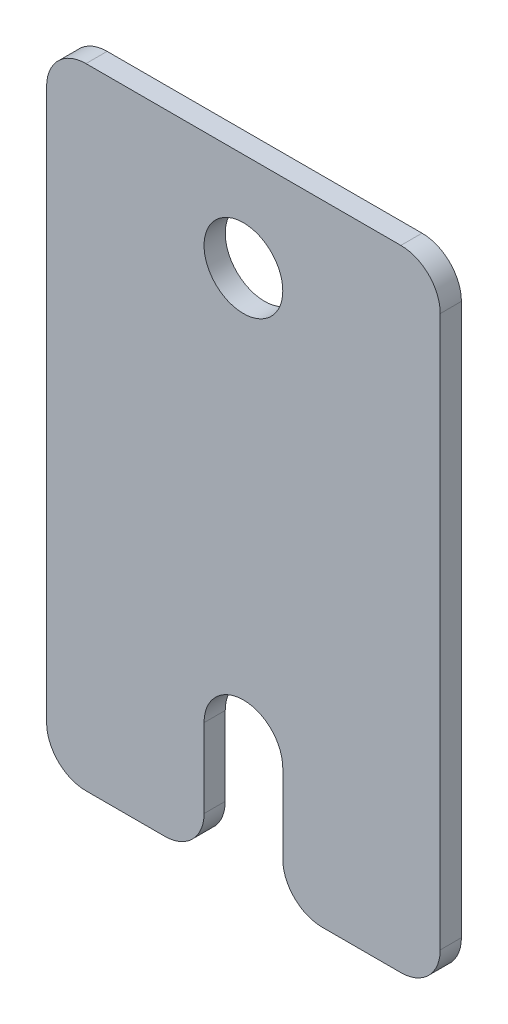
ISO-10303-21;
HEADER;
FILE_DESCRIPTION(('STEP AP214'),'2;1');
FILE_NAME('part.step','',(''),(''),'','','');
FILE_SCHEMA(('AUTOMOTIVE_DESIGN { 1 0 10303 214 1 1 1 1 }'));
ENDSEC;
DATA;
#1=APPLICATION_CONTEXT('core data for automotive mechanical design processes');
#2=APPLICATION_PROTOCOL_DEFINITION('international standard','automotive_design',2000,#1);
#3=PRODUCT_CONTEXT('',#1,'mechanical');
#4=PRODUCT('Part','Part','',(#3));
#5=PRODUCT_RELATED_PRODUCT_CATEGORY('part','',(#4));
#6=PRODUCT_DEFINITION_FORMATION('','',#4);
#7=PRODUCT_DEFINITION_CONTEXT('part definition',#1,'design');
#8=PRODUCT_DEFINITION('design','',#6,#7);
#9=PRODUCT_DEFINITION_SHAPE('','',#8);
#10=(LENGTH_UNIT() NAMED_UNIT(*) SI_UNIT(.MILLI.,.METRE.));
#11=(NAMED_UNIT(*) PLANE_ANGLE_UNIT() SI_UNIT($,.RADIAN.));
#12=(NAMED_UNIT(*) SI_UNIT($,.STERADIAN.) SOLID_ANGLE_UNIT());
#13=UNCERTAINTY_MEASURE_WITH_UNIT(LENGTH_MEASURE(1.E-05),#10,'distance_accuracy_value','');
#14=(GEOMETRIC_REPRESENTATION_CONTEXT(3) GLOBAL_UNCERTAINTY_ASSIGNED_CONTEXT((#13)) GLOBAL_UNIT_ASSIGNED_CONTEXT((#10,
#11,#12)) REPRESENTATION_CONTEXT('',''));
#15=CARTESIAN_POINT('',(0.,0.,0.));
#16=DIRECTION('',(0.,0.,1.));
#17=DIRECTION('',(1.,0.,0.));
#18=AXIS2_PLACEMENT_3D('',#15,#16,#17);
#19=CARTESIAN_POINT('',(31.75,-50.8,-3.4163));
#20=DIRECTION('',(0.,-1.,0.));
#21=DIRECTION('',(0.,0.,-1.));
#22=AXIS2_PLACEMENT_3D('',#19,#20,#21);
#23=PLANE('',#22);
#24=DIRECTION('',(1.,0.,0.));
#25=VECTOR('',#24,1.);
#26=CARTESIAN_POINT('',(31.75,-50.8,0.));
#27=LINE('',#26,#25);
#28=CARTESIAN_POINT('',(12.7,-50.8,0.));
#29=VERTEX_POINT('',#28);
#30=CARTESIAN_POINT('',(25.4,-50.8,0.));
#31=VERTEX_POINT('',#30);
#32=EDGE_CURVE('E195',#29,#31,#27,.T.);
#33=ORIENTED_EDGE('',*,*,#32,.F.);
#34=DIRECTION('',(0.,0.,1.));
#35=VECTOR('',#34,1.);
#36=CARTESIAN_POINT('',(12.7,-50.8,-3.4163));
#37=LINE('',#36,#35);
#38=CARTESIAN_POINT('',(12.7,-50.8,-3.4163));
#39=VERTEX_POINT('',#38);
#40=EDGE_CURVE('E222',#29,#39,#37,.F.);
#41=ORIENTED_EDGE('',*,*,#40,.T.);
#42=DIRECTION('',(1.,0.,0.));
#43=VECTOR('',#42,1.);
#44=CARTESIAN_POINT('',(31.75,-50.8,-3.4163));
#45=LINE('',#44,#43);
#46=CARTESIAN_POINT('',(25.4,-50.8,-3.4163));
#47=VERTEX_POINT('',#46);
#48=EDGE_CURVE('E181',#39,#47,#45,.T.);
#49=ORIENTED_EDGE('',*,*,#48,.T.);
#50=DIRECTION('',(0.,0.,1.));
#51=VECTOR('',#50,1.);
#52=CARTESIAN_POINT('',(25.4,-50.8,-3.4163));
#53=LINE('',#52,#51);
#54=EDGE_CURVE('E219',#47,#31,#53,.T.);
#55=ORIENTED_EDGE('',*,*,#54,.T.);
#56=EDGE_LOOP('',(#33,#41,#49,#55));
#57=FACE_BOUND('',#56,.T.);
#58=ADVANCED_FACE('F38',(#57),#23,.T.);
#59=CARTESIAN_POINT('',(-31.75,50.8,-3.4163));
#60=DIRECTION('',(-1.,0.,0.));
#61=DIRECTION('',(0.,-1.,0.));
#62=AXIS2_PLACEMENT_3D('',#59,#60,#61);
#63=PLANE('',#62);
#64=DIRECTION('',(0.,-1.,0.));
#65=VECTOR('',#64,1.);
#66=CARTESIAN_POINT('',(-31.75,50.8,-3.4163));
#67=LINE('',#66,#65);
#68=CARTESIAN_POINT('',(-31.75,44.45,-3.4163));
#69=VERTEX_POINT('',#68);
#70=CARTESIAN_POINT('',(-31.75,-44.45,-3.4163));
#71=VERTEX_POINT('',#70);
#72=EDGE_CURVE('E178',#69,#71,#67,.T.);
#73=ORIENTED_EDGE('',*,*,#72,.T.);
#74=DIRECTION('',(0.,0.,1.));
#75=VECTOR('',#74,1.);
#76=CARTESIAN_POINT('',(-31.75,-44.45,-3.4163));
#77=LINE('',#76,#75);
#78=CARTESIAN_POINT('',(-31.75,-44.45,0.));
#79=VERTEX_POINT('',#78);
#80=EDGE_CURVE('E247',#71,#79,#77,.T.);
#81=ORIENTED_EDGE('',*,*,#80,.T.);
#82=DIRECTION('',(0.,-1.,0.));
#83=VECTOR('',#82,1.);
#84=CARTESIAN_POINT('',(-31.75,50.8,0.));
#85=LINE('',#84,#83);
#86=CARTESIAN_POINT('',(-31.75,44.45,0.));
#87=VERTEX_POINT('',#86);
#88=EDGE_CURVE('E192',#87,#79,#85,.T.);
#89=ORIENTED_EDGE('',*,*,#88,.F.);
#90=DIRECTION('',(0.,0.,1.));
#91=VECTOR('',#90,1.);
#92=CARTESIAN_POINT('',(-31.75,44.45,-3.4163));
#93=LINE('',#92,#91);
#94=EDGE_CURVE('E245',#87,#69,#93,.F.);
#95=ORIENTED_EDGE('',*,*,#94,.T.);
#96=EDGE_LOOP('',(#73,#81,#89,#95));
#97=FACE_BOUND('',#96,.T.);
#98=ADVANCED_FACE('F290',(#97),#63,.T.);
#99=CARTESIAN_POINT('',(31.75,50.8,-3.4163));
#100=DIRECTION('',(0.,1.,0.));
#101=DIRECTION('',(0.,0.,1.));
#102=AXIS2_PLACEMENT_3D('',#99,#100,#101);
#103=PLANE('',#102);
#104=DIRECTION('',(-1.,0.,0.));
#105=VECTOR('',#104,1.);
#106=CARTESIAN_POINT('',(31.75,50.8,-3.4163));
#107=LINE('',#106,#105);
#108=CARTESIAN_POINT('',(25.4,50.8,-3.4163));
#109=VERTEX_POINT('',#108);
#110=CARTESIAN_POINT('',(-25.4,50.8,-3.4163));
#111=VERTEX_POINT('',#110);
#112=EDGE_CURVE('E188',#109,#111,#107,.T.);
#113=ORIENTED_EDGE('',*,*,#112,.T.);
#114=DIRECTION('',(0.,0.,1.));
#115=VECTOR('',#114,1.);
#116=CARTESIAN_POINT('',(-25.4,50.8,-3.4163));
#117=LINE('',#116,#115);
#118=CARTESIAN_POINT('',(-25.4,50.8,0.));
#119=VERTEX_POINT('',#118);
#120=EDGE_CURVE('E11',#111,#119,#117,.T.);
#121=ORIENTED_EDGE('',*,*,#120,.T.);
#122=DIRECTION('',(-1.,0.,0.));
#123=VECTOR('',#122,1.);
#124=CARTESIAN_POINT('',(31.75,50.8,0.));
#125=LINE('',#124,#123);
#126=CARTESIAN_POINT('',(25.4,50.8,0.));
#127=VERTEX_POINT('',#126);
#128=EDGE_CURVE('E182',#127,#119,#125,.T.);
#129=ORIENTED_EDGE('',*,*,#128,.F.);
#130=DIRECTION('',(0.,0.,1.));
#131=VECTOR('',#130,1.);
#132=CARTESIAN_POINT('',(25.4,50.8,-3.4163));
#133=LINE('',#132,#131);
#134=EDGE_CURVE('E46',#127,#109,#133,.F.);
#135=ORIENTED_EDGE('',*,*,#134,.T.);
#136=EDGE_LOOP('',(#113,#121,#129,#135));
#137=FACE_BOUND('',#136,.T.);
#138=ADVANCED_FACE('F252',(#137),#103,.T.);
#139=CARTESIAN_POINT('',(31.75,50.8,-3.4163));
#140=DIRECTION('',(1.,0.,0.));
#141=DIRECTION('',(0.,1.,0.));
#142=AXIS2_PLACEMENT_3D('',#139,#140,#141);
#143=PLANE('',#142);
#144=DIRECTION('',(0.,1.,0.));
#145=VECTOR('',#144,1.);
#146=CARTESIAN_POINT('',(31.75,50.8,0.));
#147=LINE('',#146,#145);
#148=CARTESIAN_POINT('',(31.75,-44.45,0.));
#149=VERTEX_POINT('',#148);
#150=CARTESIAN_POINT('',(31.75,44.45,0.));
#151=VERTEX_POINT('',#150);
#152=EDGE_CURVE('E200',#149,#151,#147,.T.);
#153=ORIENTED_EDGE('',*,*,#152,.F.);
#154=DIRECTION('',(0.,0.,1.));
#155=VECTOR('',#154,1.);
#156=CARTESIAN_POINT('',(31.75,-44.45,-3.4163));
#157=LINE('',#156,#155);
#158=CARTESIAN_POINT('',(31.75,-44.45,-3.4163));
#159=VERTEX_POINT('',#158);
#160=EDGE_CURVE('E60',#149,#159,#157,.F.);
#161=ORIENTED_EDGE('',*,*,#160,.T.);
#162=DIRECTION('',(0.,1.,0.));
#163=VECTOR('',#162,1.);
#164=CARTESIAN_POINT('',(31.75,50.8,-3.4163));
#165=LINE('',#164,#163);
#166=CARTESIAN_POINT('',(31.75,44.45,-3.4163));
#167=VERTEX_POINT('',#166);
#168=EDGE_CURVE('E186',#159,#167,#165,.T.);
#169=ORIENTED_EDGE('',*,*,#168,.T.);
#170=DIRECTION('',(0.,0.,1.));
#171=VECTOR('',#170,1.);
#172=CARTESIAN_POINT('',(31.75,44.45,-3.4163));
#173=LINE('',#172,#171);
#174=EDGE_CURVE('E241',#167,#151,#173,.T.);
#175=ORIENTED_EDGE('',*,*,#174,.T.);
#176=EDGE_LOOP('',(#153,#161,#169,#175));
#177=FACE_BOUND('',#176,.T.);
#178=ADVANCED_FACE('F258',(#177),#143,.T.);
#179=CARTESIAN_POINT('',(-25.4,-50.8,-3.4163));
#180=VERTEX_POINT('',#179);
#181=CARTESIAN_POINT('',(-12.7,-50.8,-3.4163));
#182=VERTEX_POINT('',#181);
#183=EDGE_CURVE('E183',#180,#182,#45,.T.);
#184=ORIENTED_EDGE('',*,*,#183,.T.);
#185=DIRECTION('',(0.,0.,1.));
#186=VECTOR('',#185,1.);
#187=CARTESIAN_POINT('',(-12.7,-50.8,0.));
#188=LINE('',#187,#186);
#189=CARTESIAN_POINT('',(-12.7,-50.8,0.));
#190=VERTEX_POINT('',#189);
#191=EDGE_CURVE('E237',#182,#190,#188,.T.);
#192=ORIENTED_EDGE('',*,*,#191,.T.);
#193=CARTESIAN_POINT('',(-25.4,-50.8,0.));
#194=VERTEX_POINT('',#193);
#195=EDGE_CURVE('E197',#194,#190,#27,.T.);
#196=ORIENTED_EDGE('',*,*,#195,.F.);
#197=DIRECTION('',(0.,0.,1.));
#198=VECTOR('',#197,1.);
#199=CARTESIAN_POINT('',(-25.4,-50.8,-3.4163));
#200=LINE('',#199,#198);
#201=EDGE_CURVE('E235',#194,#180,#200,.F.);
#202=ORIENTED_EDGE('',*,*,#201,.T.);
#203=EDGE_LOOP('',(#184,#192,#196,#202));
#204=FACE_BOUND('',#203,.T.);
#205=ADVANCED_FACE('F283',(#204),#23,.T.);
#206=CARTESIAN_POINT('',(0.,0.,-3.4163));
#207=DIRECTION('',(0.,0.,-1.));
#208=DIRECTION('',(-1.,0.,0.));
#209=AXIS2_PLACEMENT_3D('',#206,#207,#208);
#210=PLANE('',#209);
#211=CARTESIAN_POINT('',(0.,34.925,-3.4163));
#212=DIRECTION('',(0.,0.,1.));
#213=DIRECTION('',(1.,0.,0.));
#214=AXIS2_PLACEMENT_3D('',#211,#212,#213);
#215=CIRCLE('',#214,6.35);
#216=CARTESIAN_POINT('',(6.35,34.925,-3.4163));
#217=VERTEX_POINT('',#216);
#218=EDGE_CURVE('E196',#217,#217,#215,.T.);
#219=ORIENTED_EDGE('',*,*,#218,.T.);
#220=EDGE_LOOP('',(#219));
#221=FACE_BOUND('',#220,.T.);
#222=ORIENTED_EDGE('',*,*,#48,.F.);
#223=CARTESIAN_POINT('',(12.7,-44.45,-3.4163));
#224=DIRECTION('',(0.,0.,-1.));
#225=DIRECTION('',(-1.,0.,0.));
#226=AXIS2_PLACEMENT_3D('',#223,#224,#225);
#227=CIRCLE('',#226,6.35);
#228=CARTESIAN_POINT('',(6.35,-44.45,-3.4163));
#229=VERTEX_POINT('',#228);
#230=EDGE_CURVE('E233',#39,#229,#227,.T.);
#231=ORIENTED_EDGE('',*,*,#230,.T.);
#232=DIRECTION('',(0.,1.,0.));
#233=VECTOR('',#232,1.);
#234=CARTESIAN_POINT('',(6.35,-31.75,-3.4163));
#235=LINE('',#234,#233);
#236=CARTESIAN_POINT('',(6.35,-31.75,-3.4163));
#237=VERTEX_POINT('',#236);
#238=EDGE_CURVE('E153',#229,#237,#235,.T.);
#239=ORIENTED_EDGE('',*,*,#238,.T.);
#240=CARTESIAN_POINT('',(0.,-31.75,-3.4163));
#241=DIRECTION('',(0.,0.,1.));
#242=DIRECTION('',(1.,0.,0.));
#243=AXIS2_PLACEMENT_3D('',#240,#241,#242);
#244=CIRCLE('',#243,6.35);
#245=CARTESIAN_POINT('',(-6.35,-31.75,-3.4163));
#246=VERTEX_POINT('',#245);
#247=EDGE_CURVE('E146',#237,#246,#244,.T.);
#248=ORIENTED_EDGE('',*,*,#247,.T.);
#249=DIRECTION('',(0.,-1.,0.));
#250=VECTOR('',#249,1.);
#251=CARTESIAN_POINT('',(-6.35,-31.75,-3.4163));
#252=LINE('',#251,#250);
#253=CARTESIAN_POINT('',(-6.35,-44.45,-3.4163));
#254=VERTEX_POINT('',#253);
#255=EDGE_CURVE('E156',#246,#254,#252,.T.);
#256=ORIENTED_EDGE('',*,*,#255,.T.);
#257=CARTESIAN_POINT('',(-12.7,-44.45,-3.4163));
#258=DIRECTION('',(0.,0.,-1.));
#259=DIRECTION('',(-1.,0.,0.));
#260=AXIS2_PLACEMENT_3D('',#257,#258,#259);
#261=CIRCLE('',#260,6.35);
#262=EDGE_CURVE('E231',#254,#182,#261,.T.);
#263=ORIENTED_EDGE('',*,*,#262,.T.);
#264=ORIENTED_EDGE('',*,*,#183,.F.);
#265=CARTESIAN_POINT('',(-25.4,-44.45,-3.4163));
#266=DIRECTION('',(0.,0.,-1.));
#267=DIRECTION('',(-1.,0.,0.));
#268=AXIS2_PLACEMENT_3D('',#265,#266,#267);
#269=CIRCLE('',#268,6.35);
#270=EDGE_CURVE('E227',#180,#71,#269,.T.);
#271=ORIENTED_EDGE('',*,*,#270,.T.);
#272=ORIENTED_EDGE('',*,*,#72,.F.);
#273=CARTESIAN_POINT('',(-25.4,44.45,-3.4163));
#274=DIRECTION('',(0.,0.,-1.));
#275=DIRECTION('',(-1.,0.,0.));
#276=AXIS2_PLACEMENT_3D('',#273,#274,#275);
#277=CIRCLE('',#276,6.35);
#278=EDGE_CURVE('E225',#69,#111,#277,.T.);
#279=ORIENTED_EDGE('',*,*,#278,.T.);
#280=ORIENTED_EDGE('',*,*,#112,.F.);
#281=CARTESIAN_POINT('',(25.4,44.45,-3.4163));
#282=DIRECTION('',(0.,0.,-1.));
#283=DIRECTION('',(-1.,0.,0.));
#284=AXIS2_PLACEMENT_3D('',#281,#282,#283);
#285=CIRCLE('',#284,6.35);
#286=EDGE_CURVE('E53',#109,#167,#285,.T.);
#287=ORIENTED_EDGE('',*,*,#286,.T.);
#288=ORIENTED_EDGE('',*,*,#168,.F.);
#289=CARTESIAN_POINT('',(25.4,-44.45,-3.4163));
#290=DIRECTION('',(0.,0.,-1.));
#291=DIRECTION('',(-1.,0.,0.));
#292=AXIS2_PLACEMENT_3D('',#289,#290,#291);
#293=CIRCLE('',#292,6.35);
#294=EDGE_CURVE('E229',#159,#47,#293,.T.);
#295=ORIENTED_EDGE('',*,*,#294,.T.);
#296=EDGE_LOOP('',(#222,#231,#239,#248,#256,#263,#264,#271,#272,#279,#280,#287,#288,#295));
#297=FACE_BOUND('',#296,.T.);
#298=ADVANCED_FACE('F163',(#221,#297),#210,.T.);
#299=CARTESIAN_POINT('',(0.,0.,0.));
#300=DIRECTION('',(0.,0.,-1.));
#301=DIRECTION('',(-1.,0.,0.));
#302=AXIS2_PLACEMENT_3D('',#299,#300,#301);
#303=PLANE('',#302);
#304=CARTESIAN_POINT('',(0.,34.925,0.));
#305=DIRECTION('',(0.,0.,1.));
#306=DIRECTION('',(1.,0.,0.));
#307=AXIS2_PLACEMENT_3D('',#304,#305,#306);
#308=CIRCLE('',#307,6.35);
#309=CARTESIAN_POINT('',(6.35,34.925,0.));
#310=VERTEX_POINT('',#309);
#311=EDGE_CURVE('E171',#310,#310,#308,.T.);
#312=ORIENTED_EDGE('',*,*,#311,.F.);
#313=EDGE_LOOP('',(#312));
#314=FACE_BOUND('',#313,.T.);
#315=DIRECTION('',(0.,1.,0.));
#316=VECTOR('',#315,1.);
#317=CARTESIAN_POINT('',(6.35,-31.75,0.));
#318=LINE('',#317,#316);
#319=CARTESIAN_POINT('',(6.35,-44.45,0.));
#320=VERTEX_POINT('',#319);
#321=CARTESIAN_POINT('',(6.35,-31.75,0.));
#322=VERTEX_POINT('',#321);
#323=EDGE_CURVE('E166',#320,#322,#318,.T.);
#324=ORIENTED_EDGE('',*,*,#323,.F.);
#325=CARTESIAN_POINT('',(12.7,-44.45,0.));
#326=DIRECTION('',(0.,0.,-1.));
#327=DIRECTION('',(-1.,0.,0.));
#328=AXIS2_PLACEMENT_3D('',#325,#326,#327);
#329=CIRCLE('',#328,6.35);
#330=EDGE_CURVE('E217',#320,#29,#329,.F.);
#331=ORIENTED_EDGE('',*,*,#330,.T.);
#332=ORIENTED_EDGE('',*,*,#32,.T.);
#333=CARTESIAN_POINT('',(25.4,-44.45,0.));
#334=DIRECTION('',(0.,0.,-1.));
#335=DIRECTION('',(-1.,0.,0.));
#336=AXIS2_PLACEMENT_3D('',#333,#334,#335);
#337=CIRCLE('',#336,6.35);
#338=EDGE_CURVE('E213',#31,#149,#337,.F.);
#339=ORIENTED_EDGE('',*,*,#338,.T.);
#340=ORIENTED_EDGE('',*,*,#152,.T.);
#341=CARTESIAN_POINT('',(25.4,44.45,0.));
#342=DIRECTION('',(0.,0.,-1.));
#343=DIRECTION('',(-1.,0.,0.));
#344=AXIS2_PLACEMENT_3D('',#341,#342,#343);
#345=CIRCLE('',#344,6.35);
#346=EDGE_CURVE('E207',#151,#127,#345,.F.);
#347=ORIENTED_EDGE('',*,*,#346,.T.);
#348=ORIENTED_EDGE('',*,*,#128,.T.);
#349=CARTESIAN_POINT('',(-25.4,44.45,0.));
#350=DIRECTION('',(0.,0.,-1.));
#351=DIRECTION('',(-1.,0.,0.));
#352=AXIS2_PLACEMENT_3D('',#349,#350,#351);
#353=CIRCLE('',#352,6.35);
#354=EDGE_CURVE('E209',#119,#87,#353,.F.);
#355=ORIENTED_EDGE('',*,*,#354,.T.);
#356=ORIENTED_EDGE('',*,*,#88,.T.);
#357=CARTESIAN_POINT('',(-25.4,-44.45,0.));
#358=DIRECTION('',(0.,0.,-1.));
#359=DIRECTION('',(-1.,0.,0.));
#360=AXIS2_PLACEMENT_3D('',#357,#358,#359);
#361=CIRCLE('',#360,6.35);
#362=EDGE_CURVE('E211',#79,#194,#361,.F.);
#363=ORIENTED_EDGE('',*,*,#362,.T.);
#364=ORIENTED_EDGE('',*,*,#195,.T.);
#365=CARTESIAN_POINT('',(-12.7,-44.45,0.));
#366=DIRECTION('',(0.,0.,-1.));
#367=DIRECTION('',(-1.,0.,0.));
#368=AXIS2_PLACEMENT_3D('',#365,#366,#367);
#369=CIRCLE('',#368,6.35);
#370=CARTESIAN_POINT('',(-6.35,-44.45,0.));
#371=VERTEX_POINT('',#370);
#372=EDGE_CURVE('E215',#190,#371,#369,.F.);
#373=ORIENTED_EDGE('',*,*,#372,.T.);
#374=DIRECTION('',(0.,-1.,0.));
#375=VECTOR('',#374,1.);
#376=CARTESIAN_POINT('',(-6.35,-31.75,0.));
#377=LINE('',#376,#375);
#378=CARTESIAN_POINT('',(-6.35,-31.75,0.));
#379=VERTEX_POINT('',#378);
#380=EDGE_CURVE('E168',#379,#371,#377,.T.);
#381=ORIENTED_EDGE('',*,*,#380,.F.);
#382=CARTESIAN_POINT('',(0.,-31.75,0.));
#383=DIRECTION('',(0.,0.,1.));
#384=DIRECTION('',(1.,0.,0.));
#385=AXIS2_PLACEMENT_3D('',#382,#383,#384);
#386=CIRCLE('',#385,6.35);
#387=EDGE_CURVE('E148',#322,#379,#386,.T.);
#388=ORIENTED_EDGE('',*,*,#387,.F.);
#389=EDGE_LOOP('',(#324,#331,#332,#339,#340,#347,#348,#355,#356,#363,#364,#373,#381,#388));
#390=FACE_BOUND('',#389,.T.);
#391=ADVANCED_FACE('F261',(#314,#390),#303,.F.);
#392=CARTESIAN_POINT('',(0.,-31.75,-3.4163));
#393=DIRECTION('',(0.,0.,1.));
#394=DIRECTION('',(1.,0.,0.));
#395=AXIS2_PLACEMENT_3D('',#392,#393,#394);
#396=CYLINDRICAL_SURFACE('',#395,6.35);
#397=ORIENTED_EDGE('',*,*,#387,.T.);
#398=DIRECTION('',(0.,0.,1.));
#399=VECTOR('',#398,1.);
#400=CARTESIAN_POINT('',(-6.35,-31.75,-3.4163));
#401=LINE('',#400,#399);
#402=EDGE_CURVE('E141',#246,#379,#401,.T.);
#403=ORIENTED_EDGE('',*,*,#402,.F.);
#404=ORIENTED_EDGE('',*,*,#247,.F.);
#405=DIRECTION('',(0.,0.,1.));
#406=VECTOR('',#405,1.);
#407=CARTESIAN_POINT('',(6.35,-31.75,-3.4163));
#408=LINE('',#407,#406);
#409=EDGE_CURVE('E152',#237,#322,#408,.T.);
#410=ORIENTED_EDGE('',*,*,#409,.T.);
#411=EDGE_LOOP('',(#397,#403,#404,#410));
#412=FACE_BOUND('',#411,.T.);
#413=ADVANCED_FACE('F143',(#412),#396,.F.);
#414=CARTESIAN_POINT('',(6.35,-31.75,-3.4163));
#415=DIRECTION('',(1.,0.,0.));
#416=DIRECTION('',(0.,1.,0.));
#417=AXIS2_PLACEMENT_3D('',#414,#415,#416);
#418=PLANE('',#417);
#419=ORIENTED_EDGE('',*,*,#238,.F.);
#420=DIRECTION('',(0.,0.,1.));
#421=VECTOR('',#420,1.);
#422=CARTESIAN_POINT('',(6.35,-44.45,0.));
#423=LINE('',#422,#421);
#424=EDGE_CURVE('E191',#229,#320,#423,.T.);
#425=ORIENTED_EDGE('',*,*,#424,.T.);
#426=ORIENTED_EDGE('',*,*,#323,.T.);
#427=ORIENTED_EDGE('',*,*,#409,.F.);
#428=EDGE_LOOP('',(#419,#425,#426,#427));
#429=FACE_BOUND('',#428,.T.);
#430=ADVANCED_FACE('F276',(#429),#418,.F.);
#431=CARTESIAN_POINT('',(-6.35,-31.75,-3.4163));
#432=DIRECTION('',(-1.,0.,0.));
#433=DIRECTION('',(0.,-1.,0.));
#434=AXIS2_PLACEMENT_3D('',#431,#432,#433);
#435=PLANE('',#434);
#436=ORIENTED_EDGE('',*,*,#380,.T.);
#437=DIRECTION('',(0.,0.,1.));
#438=VECTOR('',#437,1.);
#439=CARTESIAN_POINT('',(-6.35,-44.45,-3.4163));
#440=LINE('',#439,#438);
#441=EDGE_CURVE('E159',#371,#254,#440,.F.);
#442=ORIENTED_EDGE('',*,*,#441,.T.);
#443=ORIENTED_EDGE('',*,*,#255,.F.);
#444=ORIENTED_EDGE('',*,*,#402,.T.);
#445=EDGE_LOOP('',(#436,#442,#443,#444));
#446=FACE_BOUND('',#445,.T.);
#447=ADVANCED_FACE('F157',(#446),#435,.F.);
#448=CARTESIAN_POINT('',(0.,34.925,-3.4163));
#449=DIRECTION('',(0.,0.,1.));
#450=DIRECTION('',(1.,0.,0.));
#451=AXIS2_PLACEMENT_3D('',#448,#449,#450);
#452=CYLINDRICAL_SURFACE('',#451,6.35);
#453=ORIENTED_EDGE('',*,*,#218,.F.);
#454=EDGE_LOOP('',(#453));
#455=FACE_BOUND('',#454,.T.);
#456=ORIENTED_EDGE('',*,*,#311,.T.);
#457=EDGE_LOOP('',(#456));
#458=FACE_BOUND('',#457,.T.);
#459=ADVANCED_FACE('F328',(#455,#458),#452,.F.);
#460=CARTESIAN_POINT('',(12.7,-44.45,-3.4163));
#461=DIRECTION('',(0.,0.,-1.));
#462=DIRECTION('',(-1.,0.,0.));
#463=AXIS2_PLACEMENT_3D('',#460,#461,#462);
#464=CYLINDRICAL_SURFACE('',#463,6.35);
#465=ORIENTED_EDGE('',*,*,#230,.F.);
#466=ORIENTED_EDGE('',*,*,#40,.F.);
#467=ORIENTED_EDGE('',*,*,#330,.F.);
#468=ORIENTED_EDGE('',*,*,#424,.F.);
#469=EDGE_LOOP('',(#465,#466,#467,#468));
#470=FACE_BOUND('',#469,.T.);
#471=ADVANCED_FACE('F274',(#470),#464,.T.);
#472=CARTESIAN_POINT('',(-12.7,-44.45,-3.4163));
#473=DIRECTION('',(0.,0.,-1.));
#474=DIRECTION('',(-1.,0.,0.));
#475=AXIS2_PLACEMENT_3D('',#472,#473,#474);
#476=CYLINDRICAL_SURFACE('',#475,6.35);
#477=ORIENTED_EDGE('',*,*,#262,.F.);
#478=ORIENTED_EDGE('',*,*,#441,.F.);
#479=ORIENTED_EDGE('',*,*,#372,.F.);
#480=ORIENTED_EDGE('',*,*,#191,.F.);
#481=EDGE_LOOP('',(#477,#478,#479,#480));
#482=FACE_BOUND('',#481,.T.);
#483=ADVANCED_FACE('F278',(#482),#476,.T.);
#484=CARTESIAN_POINT('',(25.4,-44.45,-3.4163));
#485=DIRECTION('',(0.,0.,1.));
#486=DIRECTION('',(1.,0.,0.));
#487=AXIS2_PLACEMENT_3D('',#484,#485,#486);
#488=CYLINDRICAL_SURFACE('',#487,6.35);
#489=ORIENTED_EDGE('',*,*,#294,.F.);
#490=ORIENTED_EDGE('',*,*,#160,.F.);
#491=ORIENTED_EDGE('',*,*,#338,.F.);
#492=ORIENTED_EDGE('',*,*,#54,.F.);
#493=EDGE_LOOP('',(#489,#490,#491,#492));
#494=FACE_BOUND('',#493,.T.);
#495=ADVANCED_FACE('F267',(#494),#488,.T.);
#496=CARTESIAN_POINT('',(-25.4,-44.45,-3.4163));
#497=DIRECTION('',(0.,0.,1.));
#498=DIRECTION('',(1.,0.,0.));
#499=AXIS2_PLACEMENT_3D('',#496,#497,#498);
#500=CYLINDRICAL_SURFACE('',#499,6.35);
#501=ORIENTED_EDGE('',*,*,#270,.F.);
#502=ORIENTED_EDGE('',*,*,#201,.F.);
#503=ORIENTED_EDGE('',*,*,#362,.F.);
#504=ORIENTED_EDGE('',*,*,#80,.F.);
#505=EDGE_LOOP('',(#501,#502,#503,#504));
#506=FACE_BOUND('',#505,.T.);
#507=ADVANCED_FACE('F287',(#506),#500,.T.);
#508=CARTESIAN_POINT('',(-25.4,44.45,-3.4163));
#509=DIRECTION('',(0.,0.,1.));
#510=DIRECTION('',(1.,0.,0.));
#511=AXIS2_PLACEMENT_3D('',#508,#509,#510);
#512=CYLINDRICAL_SURFACE('',#511,6.35);
#513=ORIENTED_EDGE('',*,*,#278,.F.);
#514=ORIENTED_EDGE('',*,*,#94,.F.);
#515=ORIENTED_EDGE('',*,*,#354,.F.);
#516=ORIENTED_EDGE('',*,*,#120,.F.);
#517=EDGE_LOOP('',(#513,#514,#515,#516));
#518=FACE_BOUND('',#517,.T.);
#519=ADVANCED_FACE('F294',(#518),#512,.T.);
#520=CARTESIAN_POINT('',(25.4,44.45,-3.4163));
#521=DIRECTION('',(0.,0.,1.));
#522=DIRECTION('',(1.,0.,0.));
#523=AXIS2_PLACEMENT_3D('',#520,#521,#522);
#524=CYLINDRICAL_SURFACE('',#523,6.35);
#525=ORIENTED_EDGE('',*,*,#286,.F.);
#526=ORIENTED_EDGE('',*,*,#134,.F.);
#527=ORIENTED_EDGE('',*,*,#346,.F.);
#528=ORIENTED_EDGE('',*,*,#174,.F.);
#529=EDGE_LOOP('',(#525,#526,#527,#528));
#530=FACE_BOUND('',#529,.T.);
#531=ADVANCED_FACE('F40',(#530),#524,.T.);
#532=CLOSED_SHELL('',(#58,#98,#138,#178,#205,#298,#391,#413,#430,#447,#459,#471,#483,#495,#507,
#519,#531));
#533=MANIFOLD_SOLID_BREP('B2',#532);
#534=ADVANCED_BREP_SHAPE_REPRESENTATION('',(#18,#533),#14);
#535=SHAPE_DEFINITION_REPRESENTATION(#9,#534);
ENDSEC;
END-ISO-10303-21;
